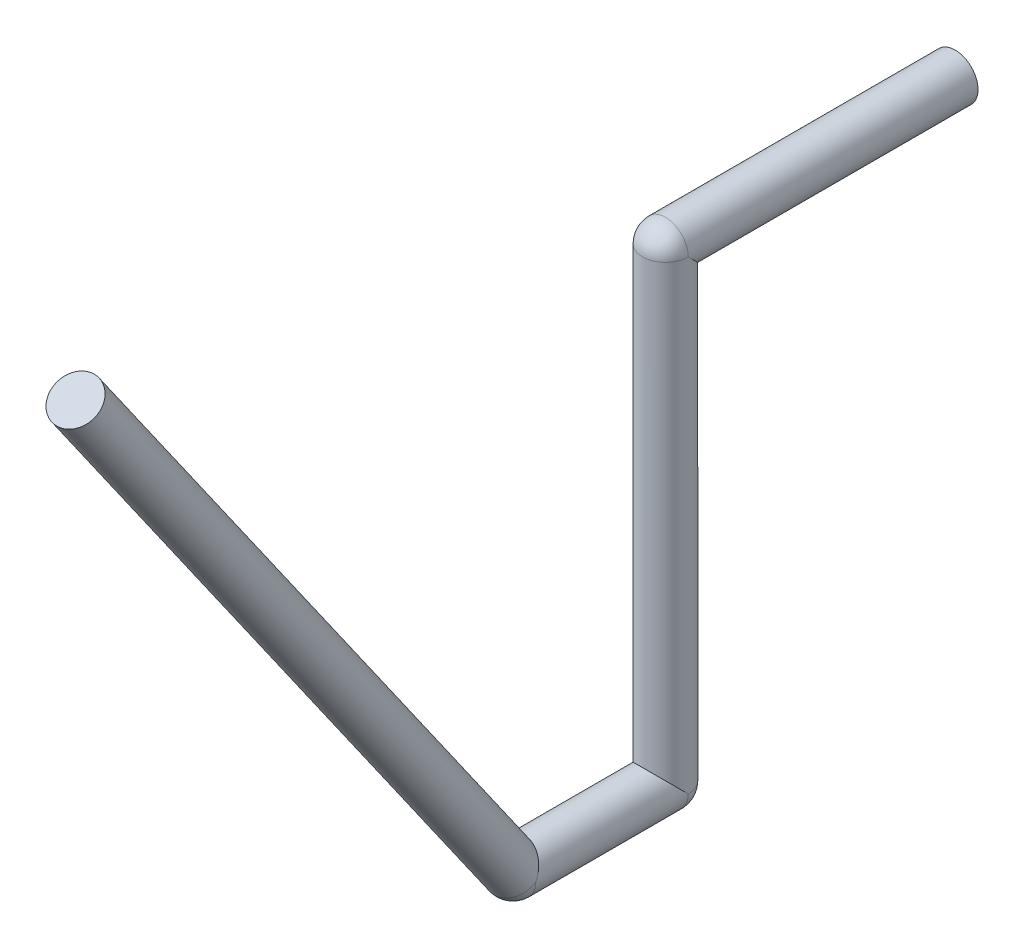
ISO-10303-21;
HEADER;
FILE_DESCRIPTION(('STEP AP214'),'2;1');
FILE_NAME('part.step','',(''),(''),'','','');
FILE_SCHEMA(('AUTOMOTIVE_DESIGN { 1 0 10303 214 1 1 1 1 }'));
ENDSEC;
DATA;
#1=APPLICATION_CONTEXT('core data for automotive mechanical design processes');
#2=APPLICATION_PROTOCOL_DEFINITION('international standard','automotive_design',2000,#1);
#3=PRODUCT_CONTEXT('',#1,'mechanical');
#4=PRODUCT('Part','Part','',(#3));
#5=PRODUCT_RELATED_PRODUCT_CATEGORY('part','',(#4));
#6=PRODUCT_DEFINITION_FORMATION('','',#4);
#7=PRODUCT_DEFINITION_CONTEXT('part definition',#1,'design');
#8=PRODUCT_DEFINITION('design','',#6,#7);
#9=PRODUCT_DEFINITION_SHAPE('','',#8);
#10=(LENGTH_UNIT() NAMED_UNIT(*) SI_UNIT(.MILLI.,.METRE.));
#11=(NAMED_UNIT(*) PLANE_ANGLE_UNIT() SI_UNIT($,.RADIAN.));
#12=(NAMED_UNIT(*) SI_UNIT($,.STERADIAN.) SOLID_ANGLE_UNIT());
#13=UNCERTAINTY_MEASURE_WITH_UNIT(LENGTH_MEASURE(1.E-05),#10,'distance_accuracy_value','');
#14=(GEOMETRIC_REPRESENTATION_CONTEXT(3) GLOBAL_UNCERTAINTY_ASSIGNED_CONTEXT((#13)) GLOBAL_UNIT_ASSIGNED_CONTEXT((#10,
#11,#12)) REPRESENTATION_CONTEXT('',''));
#15=CARTESIAN_POINT('',(0.,0.,0.));
#16=DIRECTION('',(0.,0.,1.));
#17=DIRECTION('',(1.,0.,0.));
#18=AXIS2_PLACEMENT_3D('',#15,#16,#17);
#19=CARTESIAN_POINT('',(0.6,10.4,-2.5));
#20=DIRECTION('',(0.,0.,1.));
#21=DIRECTION('',(1.,0.,0.));
#22=AXIS2_PLACEMENT_3D('',#19,#20,#21);
#23=PLANE('',#22);
#24=CARTESIAN_POINT('',(0.6,10.4,-2.5));
#25=DIRECTION('',(0.,0.,1.));
#26=DIRECTION('',(1.,0.,0.));
#27=AXIS2_PLACEMENT_3D('',#24,#25,#26);
#28=CIRCLE('',#27,0.3);
#29=CARTESIAN_POINT('',(0.3,10.4,-2.5));
#30=VERTEX_POINT('',#29);
#31=EDGE_CURVE('E11',#30,#30,#28,.T.);
#32=ORIENTED_EDGE('',*,*,#31,.F.);
#33=EDGE_LOOP('',(#32));
#34=FACE_BOUND('',#33,.T.);
#35=ADVANCED_FACE('F17',(#34),#23,.F.);
#36=CARTESIAN_POINT('',(0.6,10.4,-2.5));
#37=DIRECTION('',(0.,0.,1.));
#38=DIRECTION('',(1.,0.,0.));
#39=AXIS2_PLACEMENT_3D('',#36,#37,#38);
#40=CYLINDRICAL_SURFACE('',#39,0.3);
#41=CARTESIAN_POINT('',(0.6,10.4,1.3));
#42=DIRECTION('',(0.,-0.707106781186548,0.707106781186548));
#43=DIRECTION('',(0.,0.707106781186548,0.707106781186548));
#44=AXIS2_PLACEMENT_3D('',#41,#42,#43);
#45=ELLIPSE('',#44,0.424264068712,0.3);
#46=CARTESIAN_POINT('',(0.3,10.4,1.3));
#47=VERTEX_POINT('',#46);
#48=CARTESIAN_POINT('',(0.9,10.4,1.3));
#49=VERTEX_POINT('',#48);
#50=EDGE_CURVE('E122',#47,#49,#45,.T.);
#51=ORIENTED_EDGE('',*,*,#50,.F.);
#52=DIRECTION('',(0.,0.,-1.));
#53=VECTOR('',#52,1.);
#54=CARTESIAN_POINT('',(0.3,10.4,-2.5));
#55=LINE('',#54,#53);
#56=EDGE_CURVE('E28',#47,#30,#55,.T.);
#57=ORIENTED_EDGE('',*,*,#56,.T.);
#58=ORIENTED_EDGE('',*,*,#31,.T.);
#59=ORIENTED_EDGE('',*,*,#56,.F.);
#60=CARTESIAN_POINT('',(0.6,10.4,1.3));
#61=DIRECTION('',(0.,0.,1.));
#62=DIRECTION('',(1.,0.,0.));
#63=AXIS2_PLACEMENT_3D('',#60,#61,#62);
#64=CIRCLE('',#63,0.3);
#65=CARTESIAN_POINT('',(0.868328157299975,10.53416407865,1.3));
#66=VERTEX_POINT('',#65);
#67=EDGE_CURVE('E102',#66,#47,#64,.T.);
#68=ORIENTED_EDGE('',*,*,#67,.F.);
#69=CARTESIAN_POINT('',(0.6,10.4,1.3));
#70=DIRECTION('',(0.,0.,1.));
#71=DIRECTION('',(1.,0.,0.));
#72=AXIS2_PLACEMENT_3D('',#69,#70,#71);
#73=CIRCLE('',#72,0.3);
#74=EDGE_CURVE('E124',#49,#66,#73,.T.);
#75=ORIENTED_EDGE('',*,*,#74,.F.);
#76=EDGE_LOOP('',(#51,#57,#58,#59,#68,#75));
#77=FACE_BOUND('',#76,.T.);
#78=ADVANCED_FACE('F101',(#77),#40,.T.);
#79=CARTESIAN_POINT('',(0.6,10.4,1.3));
#80=DIRECTION('',(0.577350269189625,0.577350269189628,0.577350269189625));
#81=DIRECTION('',(-0.707106781186548,0.,0.707106781186548));
#82=AXIS2_PLACEMENT_3D('',#79,#80,#81);
#83=SPHERICAL_SURFACE('',#82,0.3);
#84=CARTESIAN_POINT('',(0.6,10.4,1.3));
#85=DIRECTION('',(0.,-1.,0.));
#86=DIRECTION('',(1.,0.,0.));
#87=AXIS2_PLACEMENT_3D('',#84,#85,#86);
#88=CIRCLE('',#87,0.3);
#89=EDGE_CURVE('E111',#49,#47,#88,.T.);
#90=ORIENTED_EDGE('',*,*,#89,.F.);
#91=ORIENTED_EDGE('',*,*,#74,.T.);
#92=CARTESIAN_POINT('',(0.6,10.4,1.3));
#93=DIRECTION('',(-0.408248290463863,0.816496580927726,-0.408248290463863));
#94=DIRECTION('',(0.707106781186548,0.,-0.707106781186548));
#95=AXIS2_PLACEMENT_3D('',#92,#93,#94);
#96=CIRCLE('',#95,0.3);
#97=CARTESIAN_POINT('',(0.773205080756888,10.5732050807569,1.47320508075689));
#98=VERTEX_POINT('',#97);
#99=EDGE_CURVE('E113',#98,#66,#96,.T.);
#100=ORIENTED_EDGE('',*,*,#99,.F.);
#101=ORIENTED_EDGE('',*,*,#99,.T.);
#102=ORIENTED_EDGE('',*,*,#67,.T.);
#103=EDGE_LOOP('',(#90,#91,#100,#101,#102));
#104=FACE_BOUND('',#103,.T.);
#105=ADVANCED_FACE('F109',(#104),#83,.T.);
#106=CARTESIAN_POINT('',(0.6,10.4,1.3));
#107=DIRECTION('',(0.,-1.,0.));
#108=DIRECTION('',(1.,0.,0.));
#109=AXIS2_PLACEMENT_3D('',#106,#107,#108);
#110=CYLINDRICAL_SURFACE('',#109,0.3);
#111=CARTESIAN_POINT('',(0.6,4.3,1.3));
#112=DIRECTION('',(0.,-1.,0.));
#113=DIRECTION('',(1.,0.,0.));
#114=AXIS2_PLACEMENT_3D('',#111,#112,#113);
#115=CIRCLE('',#114,0.3);
#116=CARTESIAN_POINT('',(0.3,4.3,1.3));
#117=VERTEX_POINT('',#116);
#118=CARTESIAN_POINT('',(0.812132034355964,4.3,1.08786796564404));
#119=VERTEX_POINT('',#118);
#120=EDGE_CURVE('E21',#117,#119,#115,.T.);
#121=ORIENTED_EDGE('',*,*,#120,.F.);
#122=DIRECTION('',(0.,1.,0.));
#123=VECTOR('',#122,1.);
#124=CARTESIAN_POINT('',(0.3,10.4,1.3));
#125=LINE('',#124,#123);
#126=EDGE_CURVE('E121',#117,#47,#125,.T.);
#127=ORIENTED_EDGE('',*,*,#126,.T.);
#128=ORIENTED_EDGE('',*,*,#50,.T.);
#129=ORIENTED_EDGE('',*,*,#89,.T.);
#130=ORIENTED_EDGE('',*,*,#126,.F.);
#131=CARTESIAN_POINT('',(0.6,4.3,1.3));
#132=DIRECTION('',(0.,-0.707106781186548,0.707106781186548));
#133=DIRECTION('',(0.,-0.707106781186548,-0.707106781186548));
#134=AXIS2_PLACEMENT_3D('',#131,#132,#133);
#135=ELLIPSE('',#134,0.424264068712,0.3);
#136=CARTESIAN_POINT('',(0.9,4.3,1.3));
#137=VERTEX_POINT('',#136);
#138=EDGE_CURVE('E140',#137,#117,#135,.T.);
#139=ORIENTED_EDGE('',*,*,#138,.F.);
#140=CARTESIAN_POINT('',(0.6,4.3,1.3));
#141=DIRECTION('',(0.,-1.,0.));
#142=DIRECTION('',(1.,0.,0.));
#143=AXIS2_PLACEMENT_3D('',#140,#141,#142);
#144=CIRCLE('',#143,0.3);
#145=EDGE_CURVE('E129',#119,#137,#144,.T.);
#146=ORIENTED_EDGE('',*,*,#145,.F.);
#147=EDGE_LOOP('',(#121,#127,#128,#129,#130,#139,#146));
#148=FACE_BOUND('',#147,.T.);
#149=ADVANCED_FACE('F118',(#148),#110,.T.);
#150=CARTESIAN_POINT('',(0.6,4.3,1.3));
#151=DIRECTION('',(0.577350269189626,0.577350269189626,0.577350269189626));
#152=DIRECTION('',(-0.707106781186548,0.,0.707106781186548));
#153=AXIS2_PLACEMENT_3D('',#150,#151,#152);
#154=SPHERICAL_SURFACE('',#153,0.3);
#155=ORIENTED_EDGE('',*,*,#120,.T.);
#156=CARTESIAN_POINT('',(0.6,4.3,1.3));
#157=DIRECTION('',(-0.408248290463863,0.816496580927726,-0.408248290463863));
#158=DIRECTION('',(0.707106781186548,0.,-0.707106781186548));
#159=AXIS2_PLACEMENT_3D('',#156,#157,#158);
#160=CIRCLE('',#159,0.3);
#161=CARTESIAN_POINT('',(0.426794919243112,4.12679491924311,1.12679491924311));
#162=VERTEX_POINT('',#161);
#163=EDGE_CURVE('E96',#119,#162,#160,.T.);
#164=ORIENTED_EDGE('',*,*,#163,.T.);
#165=ORIENTED_EDGE('',*,*,#163,.F.);
#166=ORIENTED_EDGE('',*,*,#145,.T.);
#167=CARTESIAN_POINT('',(0.6,4.3,1.3));
#168=DIRECTION('',(0.,0.,1.));
#169=DIRECTION('',(1.,0.,0.));
#170=AXIS2_PLACEMENT_3D('',#167,#168,#169);
#171=CIRCLE('',#170,0.3);
#172=EDGE_CURVE('E142',#117,#137,#171,.T.);
#173=ORIENTED_EDGE('',*,*,#172,.F.);
#174=EDGE_LOOP('',(#155,#164,#165,#166,#173));
#175=FACE_BOUND('',#174,.T.);
#176=ADVANCED_FACE('F181',(#175),#154,.T.);
#177=CARTESIAN_POINT('',(0.6,4.3,1.3));
#178=DIRECTION('',(0.,0.,1.));
#179=DIRECTION('',(1.,0.,0.));
#180=AXIS2_PLACEMENT_3D('',#177,#178,#179);
#181=CYLINDRICAL_SURFACE('',#180,0.3);
#182=CARTESIAN_POINT('',(0.6,4.3,3.3));
#183=DIRECTION('',(0.,0.,1.));
#184=DIRECTION('',(1.,0.,0.));
#185=AXIS2_PLACEMENT_3D('',#182,#183,#184);
#186=CIRCLE('',#185,0.3);
#187=CARTESIAN_POINT('',(0.3,4.3,3.3));
#188=VERTEX_POINT('',#187);
#189=CARTESIAN_POINT('',(0.9,4.3,3.3));
#190=VERTEX_POINT('',#189);
#191=EDGE_CURVE('E137',#188,#190,#186,.T.);
#192=ORIENTED_EDGE('',*,*,#191,.F.);
#193=DIRECTION('',(0.,0.,-1.));
#194=VECTOR('',#193,1.);
#195=CARTESIAN_POINT('',(0.3,4.3,1.3));
#196=LINE('',#195,#194);
#197=EDGE_CURVE('E67',#188,#117,#196,.T.);
#198=ORIENTED_EDGE('',*,*,#197,.T.);
#199=ORIENTED_EDGE('',*,*,#172,.T.);
#200=ORIENTED_EDGE('',*,*,#138,.T.);
#201=ORIENTED_EDGE('',*,*,#197,.F.);
#202=CARTESIAN_POINT('',(0.6,4.3,3.3));
#203=DIRECTION('',(0.,0.461748613235098,0.887010833178188));
#204=DIRECTION('',(0.,-0.887010833178188,0.461748613235098));
#205=AXIS2_PLACEMENT_3D('',#202,#203,#204);
#206=ELLIPSE('',#205,0.33821458406,0.3);
#207=EDGE_CURVE('E144',#190,#188,#206,.T.);
#208=ORIENTED_EDGE('',*,*,#207,.F.);
#209=EDGE_LOOP('',(#192,#198,#199,#200,#201,#208));
#210=FACE_BOUND('',#209,.T.);
#211=ADVANCED_FACE('F165',(#210),#181,.T.);
#212=CARTESIAN_POINT('',(0.6,4.3,3.3));
#213=DIRECTION('',(0.,0.,1.));
#214=DIRECTION('',(1.,0.,0.));
#215=AXIS2_PLACEMENT_3D('',#212,#213,#214);
#216=SPHERICAL_SURFACE('',#215,0.3);
#217=ORIENTED_EDGE('',*,*,#191,.T.);
#218=CARTESIAN_POINT('',(0.6,4.3,3.3));
#219=DIRECTION('',(0.,0.819152044289016,0.573576436351011));
#220=DIRECTION('',(1.,0.,0.));
#221=AXIS2_PLACEMENT_3D('',#218,#219,#220);
#222=CIRCLE('',#221,0.3);
#223=EDGE_CURVE('E147',#188,#190,#222,.T.);
#224=ORIENTED_EDGE('',*,*,#223,.F.);
#225=EDGE_LOOP('',(#217,#224));
#226=FACE_BOUND('',#225,.T.);
#227=ADVANCED_FACE('F19',(#226),#216,.T.);
#228=CARTESIAN_POINT('',(0.6,4.3,3.3));
#229=DIRECTION('',(0.,0.819152044289016,0.573576436351011));
#230=DIRECTION('',(1.,0.,0.));
#231=AXIS2_PLACEMENT_3D('',#228,#229,#230);
#232=CYLINDRICAL_SURFACE('',#231,0.3);
#233=CARTESIAN_POINT('',(0.6,12.49152044289,9.03576436351));
#234=DIRECTION('',(0.,0.819152044289016,0.573576436351011));
#235=DIRECTION('',(1.,0.,0.));
#236=AXIS2_PLACEMENT_3D('',#233,#234,#235);
#237=CIRCLE('',#236,0.3);
#238=CARTESIAN_POINT('',(0.3,12.49152044289,9.03576436351));
#239=VERTEX_POINT('',#238);
#240=EDGE_CURVE('E167',#239,#239,#237,.T.);
#241=ORIENTED_EDGE('',*,*,#240,.F.);
#242=DIRECTION('',(0.,-0.819152044289016,-0.573576436351011));
#243=VECTOR('',#242,1.);
#244=CARTESIAN_POINT('',(0.3,4.3,3.3));
#245=LINE('',#244,#243);
#246=EDGE_CURVE('E79',#239,#188,#245,.T.);
#247=ORIENTED_EDGE('',*,*,#246,.T.);
#248=ORIENTED_EDGE('',*,*,#223,.T.);
#249=ORIENTED_EDGE('',*,*,#207,.T.);
#250=ORIENTED_EDGE('',*,*,#246,.F.);
#251=EDGE_LOOP('',(#241,#247,#248,#249,#250));
#252=FACE_BOUND('',#251,.T.);
#253=ADVANCED_FACE('F166',(#252),#232,.T.);
#254=CARTESIAN_POINT('',(0.6,12.49152044289,9.03576436351));
#255=DIRECTION('',(0.,0.819152044289016,0.573576436351011));
#256=DIRECTION('',(1.,0.,0.));
#257=AXIS2_PLACEMENT_3D('',#254,#255,#256);
#258=PLANE('',#257);
#259=ORIENTED_EDGE('',*,*,#240,.T.);
#260=EDGE_LOOP('',(#259));
#261=FACE_BOUND('',#260,.T.);
#262=ADVANCED_FACE('F247',(#261),#258,.T.);
#263=CLOSED_SHELL('',(#35,#78,#105,#149,#176,#211,#227,#253,#262));
#264=MANIFOLD_SOLID_BREP('B1',#263);
#265=ADVANCED_BREP_SHAPE_REPRESENTATION('',(#18,#264),#14);
#266=SHAPE_DEFINITION_REPRESENTATION(#9,#265);
ENDSEC;
END-ISO-10303-21;
